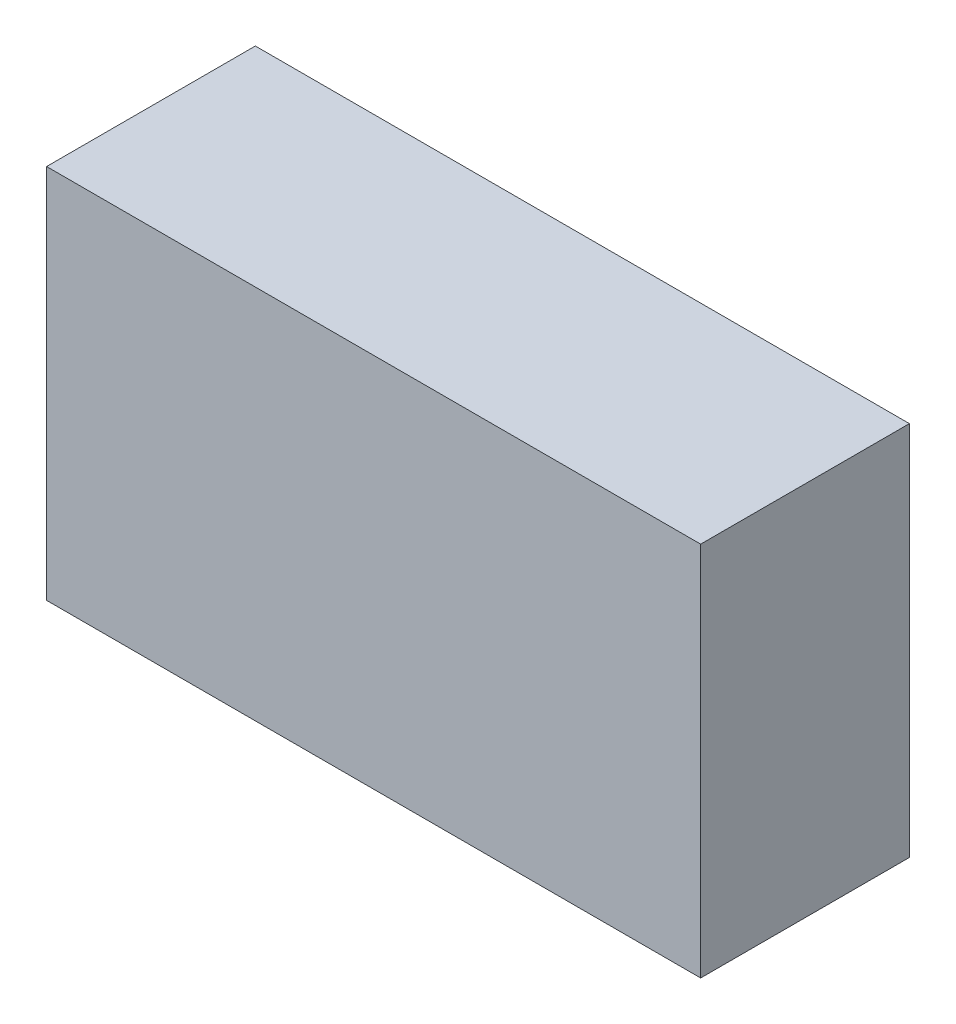
ISO-10303-21;
HEADER;
FILE_DESCRIPTION(('STEP AP214'),'2;1');
FILE_NAME('part.step','',(''),(''),'','','');
FILE_SCHEMA(('AUTOMOTIVE_DESIGN { 1 0 10303 214 1 1 1 1 }'));
ENDSEC;
DATA;
#1=APPLICATION_CONTEXT('core data for automotive mechanical design processes');
#2=APPLICATION_PROTOCOL_DEFINITION('international standard','automotive_design',2000,#1);
#3=PRODUCT_CONTEXT('',#1,'mechanical');
#4=PRODUCT('Part','Part','',(#3));
#5=PRODUCT_RELATED_PRODUCT_CATEGORY('part','',(#4));
#6=PRODUCT_DEFINITION_FORMATION('','',#4);
#7=PRODUCT_DEFINITION_CONTEXT('part definition',#1,'design');
#8=PRODUCT_DEFINITION('design','',#6,#7);
#9=PRODUCT_DEFINITION_SHAPE('','',#8);
#10=(LENGTH_UNIT() NAMED_UNIT(*) SI_UNIT(.MILLI.,.METRE.));
#11=(NAMED_UNIT(*) PLANE_ANGLE_UNIT() SI_UNIT($,.RADIAN.));
#12=(NAMED_UNIT(*) SI_UNIT($,.STERADIAN.) SOLID_ANGLE_UNIT());
#13=UNCERTAINTY_MEASURE_WITH_UNIT(LENGTH_MEASURE(1.E-05),#10,'distance_accuracy_value','');
#14=(GEOMETRIC_REPRESENTATION_CONTEXT(3) GLOBAL_UNCERTAINTY_ASSIGNED_CONTEXT((#13)) GLOBAL_UNIT_ASSIGNED_CONTEXT((#10,
#11,#12)) REPRESENTATION_CONTEXT('',''));
#15=CARTESIAN_POINT('',(0.,0.,0.));
#16=DIRECTION('',(0.,0.,1.));
#17=DIRECTION('',(1.,0.,0.));
#18=AXIS2_PLACEMENT_3D('',#15,#16,#17);
#19=CARTESIAN_POINT('',(23.5,-13.5,7.5));
#20=DIRECTION('',(-1.,0.,0.));
#21=DIRECTION('',(0.,0.,1.));
#22=AXIS2_PLACEMENT_3D('',#19,#20,#21);
#23=PLANE('',#22);
#24=DIRECTION('',(0.,1.,0.));
#25=VECTOR('',#24,1.);
#26=CARTESIAN_POINT('',(23.5,-13.5,-7.5));
#27=LINE('',#26,#25);
#28=CARTESIAN_POINT('',(23.5,-13.5,-7.5));
#29=VERTEX_POINT('',#28);
#30=CARTESIAN_POINT('',(23.5,13.5,-7.5));
#31=VERTEX_POINT('',#30);
#32=EDGE_CURVE('E109',#29,#31,#27,.T.);
#33=ORIENTED_EDGE('',*,*,#32,.T.);
#34=DIRECTION('',(0.,0.,-1.));
#35=VECTOR('',#34,1.);
#36=CARTESIAN_POINT('',(23.5,13.5,7.5));
#37=LINE('',#36,#35);
#38=CARTESIAN_POINT('',(23.5,13.5,7.5));
#39=VERTEX_POINT('',#38);
#40=EDGE_CURVE('E11',#39,#31,#37,.T.);
#41=ORIENTED_EDGE('',*,*,#40,.F.);
#42=DIRECTION('',(0.,1.,0.));
#43=VECTOR('',#42,1.);
#44=CARTESIAN_POINT('',(23.5,-13.5,7.5));
#45=LINE('',#44,#43);
#46=CARTESIAN_POINT('',(23.5,-13.5,7.5));
#47=VERTEX_POINT('',#46);
#48=EDGE_CURVE('E93',#47,#39,#45,.T.);
#49=ORIENTED_EDGE('',*,*,#48,.F.);
#50=DIRECTION('',(0.,0.,-1.));
#51=VECTOR('',#50,1.);
#52=CARTESIAN_POINT('',(23.5,-13.5,7.5));
#53=LINE('',#52,#51);
#54=EDGE_CURVE('E105',#47,#29,#53,.T.);
#55=ORIENTED_EDGE('',*,*,#54,.T.);
#56=EDGE_LOOP('',(#33,#41,#49,#55));
#57=FACE_BOUND('',#56,.T.);
#58=ADVANCED_FACE('F41',(#57),#23,.F.);
#59=CARTESIAN_POINT('',(-23.5,13.5,7.5));
#60=DIRECTION('',(0.,-1.,0.));
#61=DIRECTION('',(0.,0.,-1.));
#62=AXIS2_PLACEMENT_3D('',#59,#60,#61);
#63=PLANE('',#62);
#64=DIRECTION('',(-1.,0.,0.));
#65=VECTOR('',#64,1.);
#66=CARTESIAN_POINT('',(-23.5,13.5,-7.5));
#67=LINE('',#66,#65);
#68=CARTESIAN_POINT('',(-23.5,13.5,-7.5));
#69=VERTEX_POINT('',#68);
#70=EDGE_CURVE('E98',#31,#69,#67,.T.);
#71=ORIENTED_EDGE('',*,*,#70,.T.);
#72=DIRECTION('',(0.,0.,-1.));
#73=VECTOR('',#72,1.);
#74=CARTESIAN_POINT('',(-23.5,13.5,7.5));
#75=LINE('',#74,#73);
#76=CARTESIAN_POINT('',(-23.5,13.5,7.5));
#77=VERTEX_POINT('',#76);
#78=EDGE_CURVE('E50',#77,#69,#75,.T.);
#79=ORIENTED_EDGE('',*,*,#78,.F.);
#80=DIRECTION('',(-1.,0.,0.));
#81=VECTOR('',#80,1.);
#82=CARTESIAN_POINT('',(-23.5,13.5,7.5));
#83=LINE('',#82,#81);
#84=EDGE_CURVE('E88',#39,#77,#83,.T.);
#85=ORIENTED_EDGE('',*,*,#84,.F.);
#86=ORIENTED_EDGE('',*,*,#40,.T.);
#87=EDGE_LOOP('',(#71,#79,#85,#86));
#88=FACE_BOUND('',#87,.T.);
#89=ADVANCED_FACE('F97',(#88),#63,.F.);
#90=CARTESIAN_POINT('',(-23.5,-13.5,7.5));
#91=DIRECTION('',(1.,0.,0.));
#92=DIRECTION('',(0.,0.,-1.));
#93=AXIS2_PLACEMENT_3D('',#90,#91,#92);
#94=PLANE('',#93);
#95=DIRECTION('',(0.,-1.,0.));
#96=VECTOR('',#95,1.);
#97=CARTESIAN_POINT('',(-23.5,-13.5,-7.5));
#98=LINE('',#97,#96);
#99=CARTESIAN_POINT('',(-23.5,-13.5,-7.5));
#100=VERTEX_POINT('',#99);
#101=EDGE_CURVE('E75',#69,#100,#98,.T.);
#102=ORIENTED_EDGE('',*,*,#101,.T.);
#103=DIRECTION('',(0.,0.,-1.));
#104=VECTOR('',#103,1.);
#105=CARTESIAN_POINT('',(-23.5,-13.5,7.5));
#106=LINE('',#105,#104);
#107=CARTESIAN_POINT('',(-23.5,-13.5,7.5));
#108=VERTEX_POINT('',#107);
#109=EDGE_CURVE('E100',#108,#100,#106,.T.);
#110=ORIENTED_EDGE('',*,*,#109,.F.);
#111=DIRECTION('',(0.,-1.,0.));
#112=VECTOR('',#111,1.);
#113=CARTESIAN_POINT('',(-23.5,-13.5,7.5));
#114=LINE('',#113,#112);
#115=EDGE_CURVE('E91',#77,#108,#114,.T.);
#116=ORIENTED_EDGE('',*,*,#115,.F.);
#117=ORIENTED_EDGE('',*,*,#78,.T.);
#118=EDGE_LOOP('',(#102,#110,#116,#117));
#119=FACE_BOUND('',#118,.T.);
#120=ADVANCED_FACE('F101',(#119),#94,.F.);
#121=CARTESIAN_POINT('',(-23.5,-13.5,7.5));
#122=DIRECTION('',(0.,1.,0.));
#123=DIRECTION('',(0.,0.,1.));
#124=AXIS2_PLACEMENT_3D('',#121,#122,#123);
#125=PLANE('',#124);
#126=DIRECTION('',(1.,0.,0.));
#127=VECTOR('',#126,1.);
#128=CARTESIAN_POINT('',(-23.5,-13.5,-7.5));
#129=LINE('',#128,#127);
#130=EDGE_CURVE('E81',#100,#29,#129,.T.);
#131=ORIENTED_EDGE('',*,*,#130,.T.);
#132=ORIENTED_EDGE('',*,*,#54,.F.);
#133=DIRECTION('',(1.,0.,0.));
#134=VECTOR('',#133,1.);
#135=CARTESIAN_POINT('',(-23.5,-13.5,7.5));
#136=LINE('',#135,#134);
#137=EDGE_CURVE('E58',#108,#47,#136,.T.);
#138=ORIENTED_EDGE('',*,*,#137,.F.);
#139=ORIENTED_EDGE('',*,*,#109,.T.);
#140=EDGE_LOOP('',(#131,#132,#138,#139));
#141=FACE_BOUND('',#140,.T.);
#142=ADVANCED_FACE('F122',(#141),#125,.F.);
#143=CARTESIAN_POINT('',(0.,0.,7.5));
#144=DIRECTION('',(0.,0.,-1.));
#145=DIRECTION('',(-1.,0.,0.));
#146=AXIS2_PLACEMENT_3D('',#143,#144,#145);
#147=PLANE('',#146);
#148=ORIENTED_EDGE('',*,*,#48,.T.);
#149=ORIENTED_EDGE('',*,*,#84,.T.);
#150=ORIENTED_EDGE('',*,*,#115,.T.);
#151=ORIENTED_EDGE('',*,*,#137,.T.);
#152=EDGE_LOOP('',(#148,#149,#150,#151));
#153=FACE_BOUND('',#152,.T.);
#154=ADVANCED_FACE('F89',(#153),#147,.F.);
#155=CARTESIAN_POINT('',(0.,0.,-7.5));
#156=DIRECTION('',(0.,0.,-1.));
#157=DIRECTION('',(-1.,0.,0.));
#158=AXIS2_PLACEMENT_3D('',#155,#156,#157);
#159=PLANE('',#158);
#160=ORIENTED_EDGE('',*,*,#32,.F.);
#161=ORIENTED_EDGE('',*,*,#130,.F.);
#162=ORIENTED_EDGE('',*,*,#101,.F.);
#163=ORIENTED_EDGE('',*,*,#70,.F.);
#164=EDGE_LOOP('',(#160,#161,#162,#163));
#165=FACE_BOUND('',#164,.T.);
#166=ADVANCED_FACE('F125',(#165),#159,.T.);
#167=CLOSED_SHELL('',(#58,#89,#120,#142,#154,#166));
#168=MANIFOLD_SOLID_BREP('B2',#167);
#169=ADVANCED_BREP_SHAPE_REPRESENTATION('',(#18,#168),#14);
#170=SHAPE_DEFINITION_REPRESENTATION(#9,#169);
ENDSEC;
END-ISO-10303-21;
